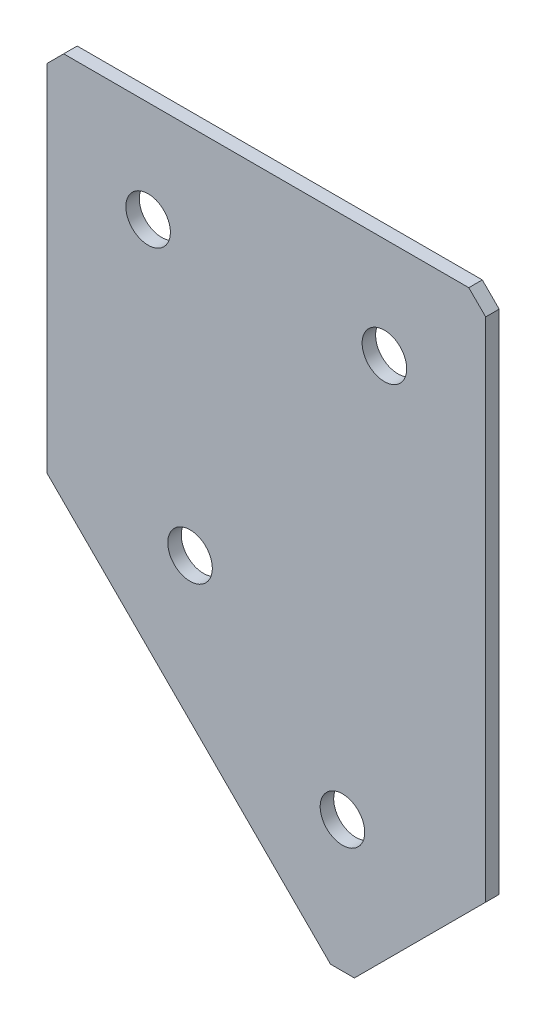
ISO-10303-21;
HEADER;
FILE_DESCRIPTION(('STEP AP214'),'2;1');
FILE_NAME('part.step','',(''),(''),'','','');
FILE_SCHEMA(('AUTOMOTIVE_DESIGN { 1 0 10303 214 1 1 1 1 }'));
ENDSEC;
DATA;
#1=APPLICATION_CONTEXT('core data for automotive mechanical design processes');
#2=APPLICATION_PROTOCOL_DEFINITION('international standard','automotive_design',2000,#1);
#3=PRODUCT_CONTEXT('',#1,'mechanical');
#4=PRODUCT('Part','Part','',(#3));
#5=PRODUCT_RELATED_PRODUCT_CATEGORY('part','',(#4));
#6=PRODUCT_DEFINITION_FORMATION('','',#4);
#7=PRODUCT_DEFINITION_CONTEXT('part definition',#1,'design');
#8=PRODUCT_DEFINITION('design','',#6,#7);
#9=PRODUCT_DEFINITION_SHAPE('','',#8);
#10=(LENGTH_UNIT() NAMED_UNIT(*) SI_UNIT(.MILLI.,.METRE.));
#11=(NAMED_UNIT(*) PLANE_ANGLE_UNIT() SI_UNIT($,.RADIAN.));
#12=(NAMED_UNIT(*) SI_UNIT($,.STERADIAN.) SOLID_ANGLE_UNIT());
#13=UNCERTAINTY_MEASURE_WITH_UNIT(LENGTH_MEASURE(1.E-05),#10,'distance_accuracy_value','');
#14=(GEOMETRIC_REPRESENTATION_CONTEXT(3) GLOBAL_UNCERTAINTY_ASSIGNED_CONTEXT((#13)) GLOBAL_UNIT_ASSIGNED_CONTEXT((#10,
#11,#12)) REPRESENTATION_CONTEXT('',''));
#15=CARTESIAN_POINT('',(0.,0.,0.));
#16=DIRECTION('',(0.,0.,1.));
#17=DIRECTION('',(1.,0.,0.));
#18=AXIS2_PLACEMENT_3D('',#15,#16,#17);
#19=CARTESIAN_POINT('',(0.,0.,-2.));
#20=DIRECTION('',(1.,0.,0.));
#21=DIRECTION('',(0.,0.,-1.));
#22=AXIS2_PLACEMENT_3D('',#19,#20,#21);
#23=PLANE('',#22);
#24=DIRECTION('',(0.,1.,0.));
#25=VECTOR('',#24,1.);
#26=CARTESIAN_POINT('',(0.,0.,0.));
#27=LINE('',#26,#25);
#28=CARTESIAN_POINT('',(0.,-55.,0.));
#29=VERTEX_POINT('',#28);
#30=CARTESIAN_POINT('',(0.,-2.50000000000002,0.));
#31=VERTEX_POINT('',#30);
#32=EDGE_CURVE('E130',#29,#31,#27,.T.);
#33=ORIENTED_EDGE('',*,*,#32,.T.);
#34=DIRECTION('',(0.,0.,-1.));
#35=VECTOR('',#34,1.);
#36=CARTESIAN_POINT('',(0.,-2.50000000000002,-2.));
#37=LINE('',#36,#35);
#38=CARTESIAN_POINT('',(0.,-2.50000000000002,-2.));
#39=VERTEX_POINT('',#38);
#40=EDGE_CURVE('E11',#31,#39,#37,.T.);
#41=ORIENTED_EDGE('',*,*,#40,.T.);
#42=DIRECTION('',(0.,1.,0.));
#43=VECTOR('',#42,1.);
#44=CARTESIAN_POINT('',(0.,0.,-2.));
#45=LINE('',#44,#43);
#46=CARTESIAN_POINT('',(0.,-55.,-2.));
#47=VERTEX_POINT('',#46);
#48=EDGE_CURVE('E141',#47,#39,#45,.T.);
#49=ORIENTED_EDGE('',*,*,#48,.F.);
#50=DIRECTION('',(0.,0.,1.));
#51=VECTOR('',#50,1.);
#52=CARTESIAN_POINT('',(0.,-55.,-2.));
#53=LINE('',#52,#51);
#54=EDGE_CURVE('E120',#47,#29,#53,.T.);
#55=ORIENTED_EDGE('',*,*,#54,.T.);
#56=EDGE_LOOP('',(#33,#41,#49,#55));
#57=FACE_BOUND('',#56,.T.);
#58=ADVANCED_FACE('F37',(#57),#23,.F.);
#59=CARTESIAN_POINT('',(0.,0.,-2.));
#60=DIRECTION('',(0.,-1.,0.));
#61=DIRECTION('',(0.,0.,-1.));
#62=AXIS2_PLACEMENT_3D('',#59,#60,#61);
#63=PLANE('',#62);
#64=DIRECTION('',(1.,0.,0.));
#65=VECTOR('',#64,1.);
#66=CARTESIAN_POINT('',(0.,0.,0.));
#67=LINE('',#66,#65);
#68=CARTESIAN_POINT('',(2.50000000000002,0.,0.));
#69=VERTEX_POINT('',#68);
#70=CARTESIAN_POINT('',(62.5,0.,0.));
#71=VERTEX_POINT('',#70);
#72=EDGE_CURVE('E133',#69,#71,#67,.T.);
#73=ORIENTED_EDGE('',*,*,#72,.T.);
#74=DIRECTION('',(0.,0.,-1.));
#75=VECTOR('',#74,1.);
#76=CARTESIAN_POINT('',(62.5,0.,-2.));
#77=LINE('',#76,#75);
#78=CARTESIAN_POINT('',(62.5,0.,-2.));
#79=VERTEX_POINT('',#78);
#80=EDGE_CURVE('E45',#71,#79,#77,.T.);
#81=ORIENTED_EDGE('',*,*,#80,.T.);
#82=DIRECTION('',(1.,0.,0.));
#83=VECTOR('',#82,1.);
#84=CARTESIAN_POINT('',(0.,0.,-2.));
#85=LINE('',#84,#83);
#86=CARTESIAN_POINT('',(2.50000000000002,0.,-2.));
#87=VERTEX_POINT('',#86);
#88=EDGE_CURVE('E109',#87,#79,#85,.T.);
#89=ORIENTED_EDGE('',*,*,#88,.F.);
#90=DIRECTION('',(0.,0.,1.));
#91=VECTOR('',#90,1.);
#92=CARTESIAN_POINT('',(2.50000000000002,0.,-2.));
#93=LINE('',#92,#91);
#94=EDGE_CURVE('E160',#87,#69,#93,.T.);
#95=ORIENTED_EDGE('',*,*,#94,.T.);
#96=EDGE_LOOP('',(#73,#81,#89,#95));
#97=FACE_BOUND('',#96,.T.);
#98=ADVANCED_FACE('F164',(#97),#63,.F.);
#99=CARTESIAN_POINT('',(65.,0.,-2.));
#100=DIRECTION('',(-1.,0.,0.));
#101=DIRECTION('',(0.,0.,1.));
#102=AXIS2_PLACEMENT_3D('',#99,#100,#101);
#103=PLANE('',#102);
#104=DIRECTION('',(0.,-1.,0.));
#105=VECTOR('',#104,1.);
#106=CARTESIAN_POINT('',(65.,0.,-2.));
#107=LINE('',#106,#105);
#108=CARTESIAN_POINT('',(65.,-2.50000000000003,-2.));
#109=VERTEX_POINT('',#108);
#110=CARTESIAN_POINT('',(65.,-77.5735931288073,-2.));
#111=VERTEX_POINT('',#110);
#112=EDGE_CURVE('E100',#109,#111,#107,.T.);
#113=ORIENTED_EDGE('',*,*,#112,.F.);
#114=DIRECTION('',(0.,0.,1.));
#115=VECTOR('',#114,1.);
#116=CARTESIAN_POINT('',(65.,-2.50000000000003,-2.));
#117=LINE('',#116,#115);
#118=CARTESIAN_POINT('',(65.,-2.50000000000003,0.));
#119=VERTEX_POINT('',#118);
#120=EDGE_CURVE('E158',#109,#119,#117,.T.);
#121=ORIENTED_EDGE('',*,*,#120,.T.);
#122=DIRECTION('',(0.,-1.,0.));
#123=VECTOR('',#122,1.);
#124=CARTESIAN_POINT('',(65.,0.,0.));
#125=LINE('',#124,#123);
#126=CARTESIAN_POINT('',(65.,-77.5735931288073,0.));
#127=VERTEX_POINT('',#126);
#128=EDGE_CURVE('E115',#119,#127,#125,.T.);
#129=ORIENTED_EDGE('',*,*,#128,.T.);
#130=DIRECTION('',(0.,0.,1.));
#131=VECTOR('',#130,1.);
#132=CARTESIAN_POINT('',(65.,-77.5735931288073,-2.));
#133=LINE('',#132,#131);
#134=EDGE_CURVE('E112',#111,#127,#133,.T.);
#135=ORIENTED_EDGE('',*,*,#134,.F.);
#136=EDGE_LOOP('',(#113,#121,#129,#135));
#137=FACE_BOUND('',#136,.T.);
#138=ADVANCED_FACE('F113',(#137),#103,.F.);
#139=CARTESIAN_POINT('',(43.7867965644035,-98.7867965644037,-2.));
#140=DIRECTION('',(-0.707106781186546,0.707106781186549,0.));
#141=DIRECTION('',(-0.707106781186549,-0.707106781186546,0.));
#142=AXIS2_PLACEMENT_3D('',#139,#140,#141);
#143=PLANE('',#142);
#144=DIRECTION('',(-0.707106781186549,-0.707106781186546,0.));
#145=VECTOR('',#144,1.);
#146=CARTESIAN_POINT('',(43.7867965644035,-98.7867965644037,0.));
#147=LINE('',#146,#145);
#148=CARTESIAN_POINT('',(45.5545635173699,-97.0190296114373,0.));
#149=VERTEX_POINT('',#148);
#150=EDGE_CURVE('E137',#127,#149,#147,.T.);
#151=ORIENTED_EDGE('',*,*,#150,.T.);
#152=DIRECTION('',(0.,0.,-1.));
#153=VECTOR('',#152,1.);
#154=CARTESIAN_POINT('',(45.5545635173699,-97.0190296114373,-2.));
#155=LINE('',#154,#153);
#156=CARTESIAN_POINT('',(45.5545635173699,-97.0190296114373,-2.));
#157=VERTEX_POINT('',#156);
#158=EDGE_CURVE('E124',#149,#157,#155,.T.);
#159=ORIENTED_EDGE('',*,*,#158,.T.);
#160=DIRECTION('',(-0.707106781186549,-0.707106781186546,0.));
#161=VECTOR('',#160,1.);
#162=CARTESIAN_POINT('',(43.7867965644035,-98.7867965644037,-2.));
#163=LINE('',#162,#161);
#164=EDGE_CURVE('E104',#111,#157,#163,.T.);
#165=ORIENTED_EDGE('',*,*,#164,.F.);
#166=ORIENTED_EDGE('',*,*,#134,.T.);
#167=EDGE_LOOP('',(#151,#159,#165,#166));
#168=FACE_BOUND('',#167,.T.);
#169=ADVANCED_FACE('F122',(#168),#143,.F.);
#170=CARTESIAN_POINT('',(0.,-55.,-2.));
#171=DIRECTION('',(0.707106781186549,0.707106781186546,0.));
#172=DIRECTION('',(-0.707106781186546,0.707106781186549,0.));
#173=AXIS2_PLACEMENT_3D('',#170,#171,#172);
#174=PLANE('',#173);
#175=DIRECTION('',(-0.707106781186546,0.707106781186549,0.));
#176=VECTOR('',#175,1.);
#177=CARTESIAN_POINT('',(0.,-55.,-2.));
#178=LINE('',#177,#176);
#179=CARTESIAN_POINT('',(42.0190296114372,-97.0190296114373,-2.));
#180=VERTEX_POINT('',#179);
#181=EDGE_CURVE('E125',#180,#47,#178,.T.);
#182=ORIENTED_EDGE('',*,*,#181,.F.);
#183=DIRECTION('',(0.,0.,1.));
#184=VECTOR('',#183,1.);
#185=CARTESIAN_POINT('',(42.0190296114372,-97.0190296114373,-2.));
#186=LINE('',#185,#184);
#187=CARTESIAN_POINT('',(42.0190296114372,-97.0190296114373,0.));
#188=VERTEX_POINT('',#187);
#189=EDGE_CURVE('E119',#180,#188,#186,.T.);
#190=ORIENTED_EDGE('',*,*,#189,.T.);
#191=DIRECTION('',(-0.707106781186546,0.707106781186549,0.));
#192=VECTOR('',#191,1.);
#193=CARTESIAN_POINT('',(0.,-55.,0.));
#194=LINE('',#193,#192);
#195=EDGE_CURVE('E139',#188,#29,#194,.T.);
#196=ORIENTED_EDGE('',*,*,#195,.T.);
#197=ORIENTED_EDGE('',*,*,#54,.F.);
#198=EDGE_LOOP('',(#182,#190,#196,#197));
#199=FACE_BOUND('',#198,.T.);
#200=ADVANCED_FACE('F194',(#199),#174,.F.);
#201=CARTESIAN_POINT('',(0.,0.,-2.));
#202=DIRECTION('',(0.,0.,1.));
#203=DIRECTION('',(1.,0.,0.));
#204=AXIS2_PLACEMENT_3D('',#201,#202,#203);
#205=PLANE('',#204);
#206=CARTESIAN_POINT('',(15.,-15.,-2.));
#207=DIRECTION('',(0.,0.,-1.));
#208=DIRECTION('',(0.,1.,0.));
#209=AXIS2_PLACEMENT_3D('',#206,#207,#208);
#210=CIRCLE('',#209,3.3);
#211=CARTESIAN_POINT('',(15.,-11.7,-2.));
#212=VERTEX_POINT('',#211);
#213=EDGE_CURVE('E226',#212,#212,#210,.T.);
#214=ORIENTED_EDGE('',*,*,#213,.F.);
#215=EDGE_LOOP('',(#214));
#216=FACE_BOUND('',#215,.T.);
#217=CARTESIAN_POINT('',(50.,-15.,-2.));
#218=DIRECTION('',(0.,0.,-1.));
#219=DIRECTION('',(0.,1.,0.));
#220=AXIS2_PLACEMENT_3D('',#217,#218,#219);
#221=CIRCLE('',#220,3.3);
#222=CARTESIAN_POINT('',(50.,-11.7,-2.));
#223=VERTEX_POINT('',#222);
#224=EDGE_CURVE('E228',#223,#223,#221,.T.);
#225=ORIENTED_EDGE('',*,*,#224,.F.);
#226=EDGE_LOOP('',(#225));
#227=FACE_BOUND('',#226,.T.);
#228=CARTESIAN_POINT('',(21.2132034355964,-55.0000000000002,-2.));
#229=DIRECTION('',(0.,0.,-1.));
#230=DIRECTION('',(0.,1.,0.));
#231=AXIS2_PLACEMENT_3D('',#228,#229,#230);
#232=CIRCLE('',#231,3.3);
#233=CARTESIAN_POINT('',(21.2132034355964,-51.7000000000002,-2.));
#234=VERTEX_POINT('',#233);
#235=EDGE_CURVE('E236',#234,#234,#232,.T.);
#236=ORIENTED_EDGE('',*,*,#235,.F.);
#237=EDGE_LOOP('',(#236));
#238=FACE_BOUND('',#237,.T.);
#239=CARTESIAN_POINT('',(43.7867965644036,-77.5735931288073,-2.));
#240=DIRECTION('',(0.,0.,-1.));
#241=DIRECTION('',(0.,1.,0.));
#242=AXIS2_PLACEMENT_3D('',#239,#240,#241);
#243=CIRCLE('',#242,3.3);
#244=CARTESIAN_POINT('',(43.7867965644036,-74.2735931288073,-2.));
#245=VERTEX_POINT('',#244);
#246=EDGE_CURVE('E242',#245,#245,#243,.T.);
#247=ORIENTED_EDGE('',*,*,#246,.F.);
#248=EDGE_LOOP('',(#247));
#249=FACE_BOUND('',#248,.T.);
#250=ORIENTED_EDGE('',*,*,#164,.T.);
#251=DIRECTION('',(1.,0.,0.));
#252=VECTOR('',#251,1.);
#253=CARTESIAN_POINT('',(42.0190296114372,-97.0190296114373,-2.));
#254=LINE('',#253,#252);
#255=EDGE_CURVE('E156',#157,#180,#254,.F.);
#256=ORIENTED_EDGE('',*,*,#255,.T.);
#257=ORIENTED_EDGE('',*,*,#181,.T.);
#258=ORIENTED_EDGE('',*,*,#48,.T.);
#259=DIRECTION('',(-0.707106781186548,-0.707106781186548,0.));
#260=VECTOR('',#259,1.);
#261=CARTESIAN_POINT('',(2.50000000000002,0.,-2.));
#262=LINE('',#261,#260);
#263=EDGE_CURVE('E153',#39,#87,#262,.F.);
#264=ORIENTED_EDGE('',*,*,#263,.T.);
#265=ORIENTED_EDGE('',*,*,#88,.T.);
#266=DIRECTION('',(-0.707106781186548,0.707106781186548,0.));
#267=VECTOR('',#266,1.);
#268=CARTESIAN_POINT('',(65.,-2.50000000000003,-2.));
#269=LINE('',#268,#267);
#270=EDGE_CURVE('E52',#79,#109,#269,.F.);
#271=ORIENTED_EDGE('',*,*,#270,.T.);
#272=ORIENTED_EDGE('',*,*,#112,.T.);
#273=EDGE_LOOP('',(#250,#256,#257,#258,#264,#265,#271,#272));
#274=FACE_BOUND('',#273,.T.);
#275=ADVANCED_FACE('F102',(#216,#227,#238,#249,#274),#205,.F.);
#276=CARTESIAN_POINT('',(0.,0.,0.));
#277=DIRECTION('',(0.,0.,1.));
#278=DIRECTION('',(1.,0.,0.));
#279=AXIS2_PLACEMENT_3D('',#276,#277,#278);
#280=PLANE('',#279);
#281=CARTESIAN_POINT('',(15.,-15.,0.));
#282=DIRECTION('',(0.,0.,-1.));
#283=DIRECTION('',(0.,1.,0.));
#284=AXIS2_PLACEMENT_3D('',#281,#282,#283);
#285=CIRCLE('',#284,3.3);
#286=CARTESIAN_POINT('',(15.,-11.7,0.));
#287=VERTEX_POINT('',#286);
#288=EDGE_CURVE('E223',#287,#287,#285,.T.);
#289=ORIENTED_EDGE('',*,*,#288,.T.);
#290=EDGE_LOOP('',(#289));
#291=FACE_BOUND('',#290,.T.);
#292=CARTESIAN_POINT('',(50.,-15.,0.));
#293=DIRECTION('',(0.,0.,-1.));
#294=DIRECTION('',(0.,1.,0.));
#295=AXIS2_PLACEMENT_3D('',#292,#293,#294);
#296=CIRCLE('',#295,3.3);
#297=CARTESIAN_POINT('',(50.,-11.7,0.));
#298=VERTEX_POINT('',#297);
#299=EDGE_CURVE('E233',#298,#298,#296,.T.);
#300=ORIENTED_EDGE('',*,*,#299,.T.);
#301=EDGE_LOOP('',(#300));
#302=FACE_BOUND('',#301,.T.);
#303=CARTESIAN_POINT('',(21.2132034355964,-55.0000000000002,0.));
#304=DIRECTION('',(0.,0.,-1.));
#305=DIRECTION('',(0.,1.,0.));
#306=AXIS2_PLACEMENT_3D('',#303,#304,#305);
#307=CIRCLE('',#306,3.3);
#308=CARTESIAN_POINT('',(21.2132034355964,-51.7000000000002,0.));
#309=VERTEX_POINT('',#308);
#310=EDGE_CURVE('E239',#309,#309,#307,.T.);
#311=ORIENTED_EDGE('',*,*,#310,.T.);
#312=EDGE_LOOP('',(#311));
#313=FACE_BOUND('',#312,.T.);
#314=CARTESIAN_POINT('',(43.7867965644036,-77.5735931288073,0.));
#315=DIRECTION('',(0.,0.,-1.));
#316=DIRECTION('',(0.,1.,0.));
#317=AXIS2_PLACEMENT_3D('',#314,#315,#316);
#318=CIRCLE('',#317,3.3);
#319=CARTESIAN_POINT('',(43.7867965644036,-74.2735931288073,0.));
#320=VERTEX_POINT('',#319);
#321=EDGE_CURVE('E134',#320,#320,#318,.T.);
#322=ORIENTED_EDGE('',*,*,#321,.T.);
#323=EDGE_LOOP('',(#322));
#324=FACE_BOUND('',#323,.T.);
#325=ORIENTED_EDGE('',*,*,#195,.F.);
#326=DIRECTION('',(-1.,0.,0.));
#327=VECTOR('',#326,1.);
#328=CARTESIAN_POINT('',(-3.80822116854336E-13,-97.0190296114372,0.));
#329=LINE('',#328,#327);
#330=EDGE_CURVE('E150',#188,#149,#329,.F.);
#331=ORIENTED_EDGE('',*,*,#330,.T.);
#332=ORIENTED_EDGE('',*,*,#150,.F.);
#333=ORIENTED_EDGE('',*,*,#128,.F.);
#334=DIRECTION('',(0.707106781186548,-0.707106781186548,0.));
#335=VECTOR('',#334,1.);
#336=CARTESIAN_POINT('',(31.25,31.25,0.));
#337=LINE('',#336,#335);
#338=EDGE_CURVE('E148',#119,#71,#337,.F.);
#339=ORIENTED_EDGE('',*,*,#338,.T.);
#340=ORIENTED_EDGE('',*,*,#72,.F.);
#341=DIRECTION('',(0.707106781186548,0.707106781186548,0.));
#342=VECTOR('',#341,1.);
#343=CARTESIAN_POINT('',(1.25000000000001,-1.25000000000001,0.));
#344=LINE('',#343,#342);
#345=EDGE_CURVE('E146',#69,#31,#344,.F.);
#346=ORIENTED_EDGE('',*,*,#345,.T.);
#347=ORIENTED_EDGE('',*,*,#32,.F.);
#348=EDGE_LOOP('',(#325,#331,#332,#333,#339,#340,#346,#347));
#349=FACE_BOUND('',#348,.T.);
#350=ADVANCED_FACE('F169',(#291,#302,#313,#324,#349),#280,.T.);
#351=CARTESIAN_POINT('',(43.7867965644036,-77.5735931288073,-2.));
#352=DIRECTION('',(0.,0.,-1.));
#353=DIRECTION('',(0.,1.,0.));
#354=AXIS2_PLACEMENT_3D('',#351,#352,#353);
#355=CYLINDRICAL_SURFACE('',#354,3.3);
#356=ORIENTED_EDGE('',*,*,#321,.F.);
#357=EDGE_LOOP('',(#356));
#358=FACE_BOUND('',#357,.T.);
#359=ORIENTED_EDGE('',*,*,#246,.T.);
#360=EDGE_LOOP('',(#359));
#361=FACE_BOUND('',#360,.T.);
#362=ADVANCED_FACE('F200',(#358,#361),#355,.F.);
#363=CARTESIAN_POINT('',(21.2132034355964,-55.0000000000002,-2.));
#364=DIRECTION('',(0.,0.,-1.));
#365=DIRECTION('',(0.,1.,0.));
#366=AXIS2_PLACEMENT_3D('',#363,#364,#365);
#367=CYLINDRICAL_SURFACE('',#366,3.3);
#368=ORIENTED_EDGE('',*,*,#310,.F.);
#369=EDGE_LOOP('',(#368));
#370=FACE_BOUND('',#369,.T.);
#371=ORIENTED_EDGE('',*,*,#235,.T.);
#372=EDGE_LOOP('',(#371));
#373=FACE_BOUND('',#372,.T.);
#374=ADVANCED_FACE('F207',(#370,#373),#367,.F.);
#375=CARTESIAN_POINT('',(50.,-15.,-2.));
#376=DIRECTION('',(0.,0.,-1.));
#377=DIRECTION('',(0.,1.,0.));
#378=AXIS2_PLACEMENT_3D('',#375,#376,#377);
#379=CYLINDRICAL_SURFACE('',#378,3.3);
#380=ORIENTED_EDGE('',*,*,#299,.F.);
#381=EDGE_LOOP('',(#380));
#382=FACE_BOUND('',#381,.T.);
#383=ORIENTED_EDGE('',*,*,#224,.T.);
#384=EDGE_LOOP('',(#383));
#385=FACE_BOUND('',#384,.T.);
#386=ADVANCED_FACE('F211',(#382,#385),#379,.F.);
#387=CARTESIAN_POINT('',(15.,-15.,-2.));
#388=DIRECTION('',(0.,0.,-1.));
#389=DIRECTION('',(0.,1.,0.));
#390=AXIS2_PLACEMENT_3D('',#387,#388,#389);
#391=CYLINDRICAL_SURFACE('',#390,3.3);
#392=ORIENTED_EDGE('',*,*,#288,.F.);
#393=EDGE_LOOP('',(#392));
#394=FACE_BOUND('',#393,.T.);
#395=ORIENTED_EDGE('',*,*,#213,.T.);
#396=EDGE_LOOP('',(#395));
#397=FACE_BOUND('',#396,.T.);
#398=ADVANCED_FACE('F179',(#394,#397),#391,.F.);
#399=CARTESIAN_POINT('',(42.0190296114372,-97.0190296114373,-2.));
#400=DIRECTION('',(0.,1.,0.));
#401=DIRECTION('',(0.,0.,1.));
#402=AXIS2_PLACEMENT_3D('',#399,#400,#401);
#403=PLANE('',#402);
#404=ORIENTED_EDGE('',*,*,#255,.F.);
#405=ORIENTED_EDGE('',*,*,#158,.F.);
#406=ORIENTED_EDGE('',*,*,#330,.F.);
#407=ORIENTED_EDGE('',*,*,#189,.F.);
#408=EDGE_LOOP('',(#404,#405,#406,#407));
#409=FACE_BOUND('',#408,.T.);
#410=ADVANCED_FACE('F174',(#409),#403,.F.);
#411=CARTESIAN_POINT('',(65.,-2.50000000000003,-2.));
#412=DIRECTION('',(-0.707106781186547,-0.707106781186547,0.));
#413=DIRECTION('',(0.,0.,1.));
#414=AXIS2_PLACEMENT_3D('',#411,#412,#413);
#415=PLANE('',#414);
#416=ORIENTED_EDGE('',*,*,#270,.F.);
#417=ORIENTED_EDGE('',*,*,#80,.F.);
#418=ORIENTED_EDGE('',*,*,#338,.F.);
#419=ORIENTED_EDGE('',*,*,#120,.F.);
#420=EDGE_LOOP('',(#416,#417,#418,#419));
#421=FACE_BOUND('',#420,.T.);
#422=ADVANCED_FACE('F172',(#421),#415,.F.);
#423=CARTESIAN_POINT('',(2.50000000000002,0.,-2.));
#424=DIRECTION('',(0.707106781186547,-0.707106781186547,0.));
#425=DIRECTION('',(0.,0.,1.));
#426=AXIS2_PLACEMENT_3D('',#423,#424,#425);
#427=PLANE('',#426);
#428=ORIENTED_EDGE('',*,*,#263,.F.);
#429=ORIENTED_EDGE('',*,*,#40,.F.);
#430=ORIENTED_EDGE('',*,*,#345,.F.);
#431=ORIENTED_EDGE('',*,*,#94,.F.);
#432=EDGE_LOOP('',(#428,#429,#430,#431));
#433=FACE_BOUND('',#432,.T.);
#434=ADVANCED_FACE('F39',(#433),#427,.F.);
#435=CLOSED_SHELL('',(#58,#98,#138,#169,#200,#275,#350,#362,#374,#386,#398,#410,#422,#434));
#436=MANIFOLD_SOLID_BREP('B2',#435);
#437=ADVANCED_BREP_SHAPE_REPRESENTATION('',(#18,#436),#14);
#438=SHAPE_DEFINITION_REPRESENTATION(#9,#437);
ENDSEC;
END-ISO-10303-21;
